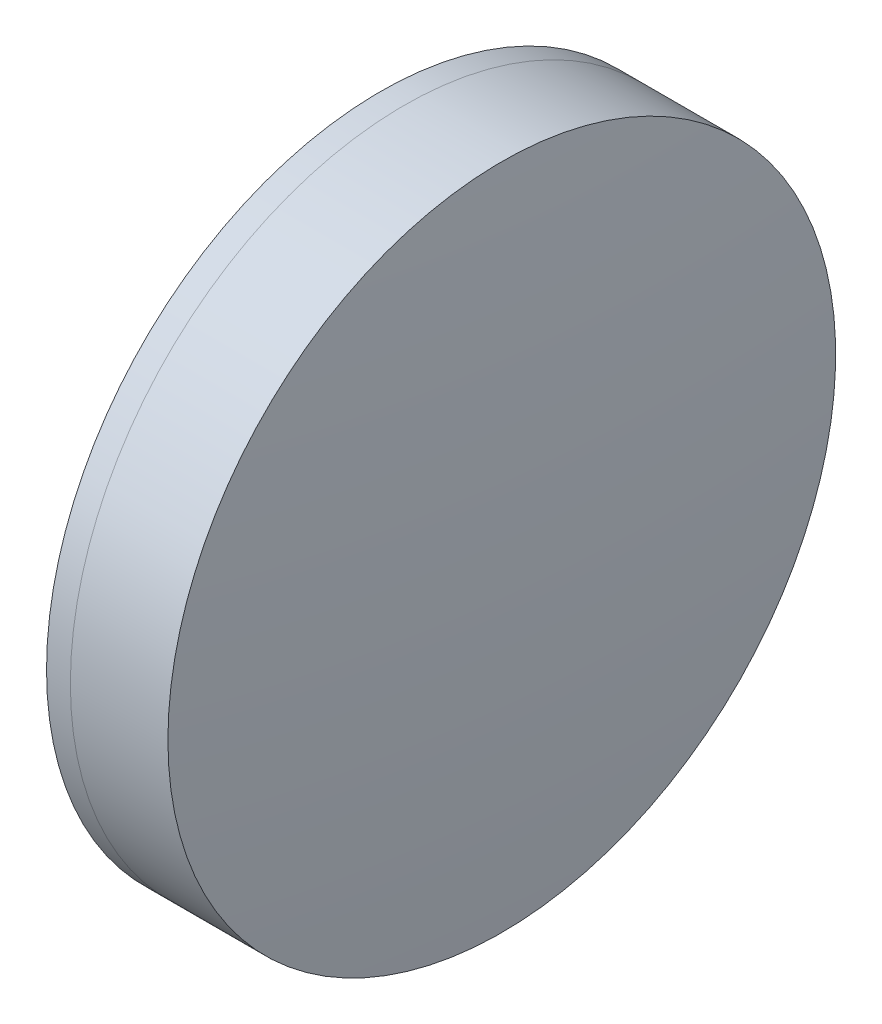
ISO-10303-21;
HEADER;
FILE_DESCRIPTION(('STEP AP214'),'2;1');
FILE_NAME('part.step','',(''),(''),'','','');
FILE_SCHEMA(('AUTOMOTIVE_DESIGN { 1 0 10303 214 1 1 1 1 }'));
ENDSEC;
DATA;
#1=APPLICATION_CONTEXT('core data for automotive mechanical design processes');
#2=APPLICATION_PROTOCOL_DEFINITION('international standard','automotive_design',2000,#1);
#3=PRODUCT_CONTEXT('',#1,'mechanical');
#4=PRODUCT('Part','Part','',(#3));
#5=PRODUCT_RELATED_PRODUCT_CATEGORY('part','',(#4));
#6=PRODUCT_DEFINITION_FORMATION('','',#4);
#7=PRODUCT_DEFINITION_CONTEXT('part definition',#1,'design');
#8=PRODUCT_DEFINITION('design','',#6,#7);
#9=PRODUCT_DEFINITION_SHAPE('','',#8);
#10=(LENGTH_UNIT() NAMED_UNIT(*) SI_UNIT(.MILLI.,.METRE.));
#11=(NAMED_UNIT(*) PLANE_ANGLE_UNIT() SI_UNIT($,.RADIAN.));
#12=(NAMED_UNIT(*) SI_UNIT($,.STERADIAN.) SOLID_ANGLE_UNIT());
#13=UNCERTAINTY_MEASURE_WITH_UNIT(LENGTH_MEASURE(1.E-05),#10,'distance_accuracy_value','');
#14=(GEOMETRIC_REPRESENTATION_CONTEXT(3) GLOBAL_UNCERTAINTY_ASSIGNED_CONTEXT((#13)) GLOBAL_UNIT_ASSIGNED_CONTEXT((#10,
#11,#12)) REPRESENTATION_CONTEXT('',''));
#15=CARTESIAN_POINT('',(0.,0.,0.));
#16=DIRECTION('',(0.,0.,1.));
#17=DIRECTION('',(1.,0.,0.));
#18=AXIS2_PLACEMENT_3D('',#15,#16,#17);
#19=CARTESIAN_POINT('',(446.886753220096,0.,0.));
#20=DIRECTION('',(-1.,0.,0.));
#21=DIRECTION('',(0.,0.,1.));
#22=AXIS2_PLACEMENT_3D('',#19,#20,#21);
#23=SPHERICAL_SURFACE('',#22,93.1);
#24=CARTESIAN_POINT('',(536.454883713034,0.,0.));
#25=DIRECTION('',(-1.,0.,0.));
#26=DIRECTION('',(0.,0.,1.));
#27=AXIS2_PLACEMENT_3D('',#24,#25,#26);
#28=CIRCLE('',#27,25.4);
#29=CARTESIAN_POINT('',(536.454883713034,0.,25.4));
#30=VERTEX_POINT('',#29);
#31=EDGE_CURVE('E11',#30,#30,#28,.T.);
#32=ORIENTED_EDGE('',*,*,#31,.T.);
#33=EDGE_LOOP('',(#32));
#34=FACE_BOUND('',#33,.T.);
#35=ADVANCED_FACE('F45',(#34),#23,.F.);
#36=CARTESIAN_POINT('',(-0.551919992657797,0.,0.));
#37=DIRECTION('',(-1.,0.,0.));
#38=DIRECTION('',(0.,0.,1.));
#39=AXIS2_PLACEMENT_3D('',#36,#37,#38);
#40=CYLINDRICAL_SURFACE('',#39,25.4);
#41=CARTESIAN_POINT('',(543.876494417953,0.,0.));
#42=DIRECTION('',(-1.,0.,0.));
#43=DIRECTION('',(0.,0.,1.));
#44=AXIS2_PLACEMENT_3D('',#41,#42,#43);
#45=CIRCLE('',#44,25.4);
#46=CARTESIAN_POINT('',(543.876494417953,0.,25.4));
#47=VERTEX_POINT('',#46);
#48=EDGE_CURVE('E51',#47,#47,#45,.T.);
#49=ORIENTED_EDGE('',*,*,#48,.T.);
#50=EDGE_LOOP('',(#49));
#51=FACE_BOUND('',#50,.T.);
#52=ORIENTED_EDGE('',*,*,#31,.F.);
#53=EDGE_LOOP('',(#52));
#54=FACE_BOUND('',#53,.T.);
#55=ADVANCED_FACE('F57',(#51,#54),#40,.T.);
#56=CARTESIAN_POINT('',(253.886753220096,0.,0.));
#57=DIRECTION('',(-1.,0.,0.));
#58=DIRECTION('',(0.,0.,1.));
#59=AXIS2_PLACEMENT_3D('',#56,#57,#58);
#60=SPHERICAL_SURFACE('',#59,291.1);
#61=ORIENTED_EDGE('',*,*,#48,.F.);
#62=EDGE_LOOP('',(#61));
#63=FACE_BOUND('',#62,.T.);
#64=ADVANCED_FACE('F60',(#63),#60,.T.);
#65=CLOSED_SHELL('',(#35,#55,#64));
#66=MANIFOLD_SOLID_BREP('B2',#65);
#67=CARTESIAN_POINT('',(579.786753220096,0.,0.));
#68=DIRECTION('',(-1.,0.,0.));
#69=DIRECTION('',(0.,0.,1.));
#70=AXIS2_PLACEMENT_3D('',#67,#68,#69);
#71=SPHERICAL_SURFACE('',#70,51.8);
#72=CARTESIAN_POINT('',(534.641653818278,0.,0.));
#73=DIRECTION('',(-1.,0.,0.));
#74=DIRECTION('',(0.,0.,1.));
#75=AXIS2_PLACEMENT_3D('',#72,#73,#74);
#76=CIRCLE('',#75,25.4);
#77=CARTESIAN_POINT('',(534.641653818278,0.,25.4));
#78=VERTEX_POINT('',#77);
#79=EDGE_CURVE('E44',#78,#78,#76,.T.);
#80=ORIENTED_EDGE('',*,*,#79,.T.);
#81=EDGE_LOOP('',(#80));
#82=FACE_BOUND('',#81,.T.);
#83=ADVANCED_FACE('F86',(#82),#71,.T.);
#84=CARTESIAN_POINT('',(124.523309526045,0.,0.));
#85=DIRECTION('',(-1.,0.,0.));
#86=DIRECTION('',(0.,0.,1.));
#87=AXIS2_PLACEMENT_3D('',#84,#85,#86);
#88=CYLINDRICAL_SURFACE('',#87,25.4);
#89=CARTESIAN_POINT('',(536.454883713034,0.,0.));
#90=DIRECTION('',(-1.,0.,0.));
#91=DIRECTION('',(0.,0.,1.));
#92=AXIS2_PLACEMENT_3D('',#89,#90,#91);
#93=CIRCLE('',#92,25.4);
#94=CARTESIAN_POINT('',(536.454883713034,0.,25.4));
#95=VERTEX_POINT('',#94);
#96=EDGE_CURVE('E92',#95,#95,#93,.T.);
#97=ORIENTED_EDGE('',*,*,#96,.T.);
#98=EDGE_LOOP('',(#97));
#99=FACE_BOUND('',#98,.T.);
#100=ORIENTED_EDGE('',*,*,#79,.F.);
#101=EDGE_LOOP('',(#100));
#102=FACE_BOUND('',#101,.T.);
#103=ADVANCED_FACE('F98',(#99,#102),#88,.T.);
#104=CARTESIAN_POINT('',(446.886753220096,0.,0.));
#105=DIRECTION('',(-1.,0.,0.));
#106=DIRECTION('',(0.,0.,1.));
#107=AXIS2_PLACEMENT_3D('',#104,#105,#106);
#108=SPHERICAL_SURFACE('',#107,93.1);
#109=ORIENTED_EDGE('',*,*,#96,.F.);
#110=EDGE_LOOP('',(#109));
#111=FACE_BOUND('',#110,.T.);
#112=ADVANCED_FACE('F101',(#111),#108,.T.);
#113=CLOSED_SHELL('',(#83,#103,#112));
#114=MANIFOLD_SOLID_BREP('B6',#113);
#115=ADVANCED_BREP_SHAPE_REPRESENTATION('',(#18,#66,#114),#14);
#116=SHAPE_DEFINITION_REPRESENTATION(#9,#115);
ENDSEC;
END-ISO-10303-21;
